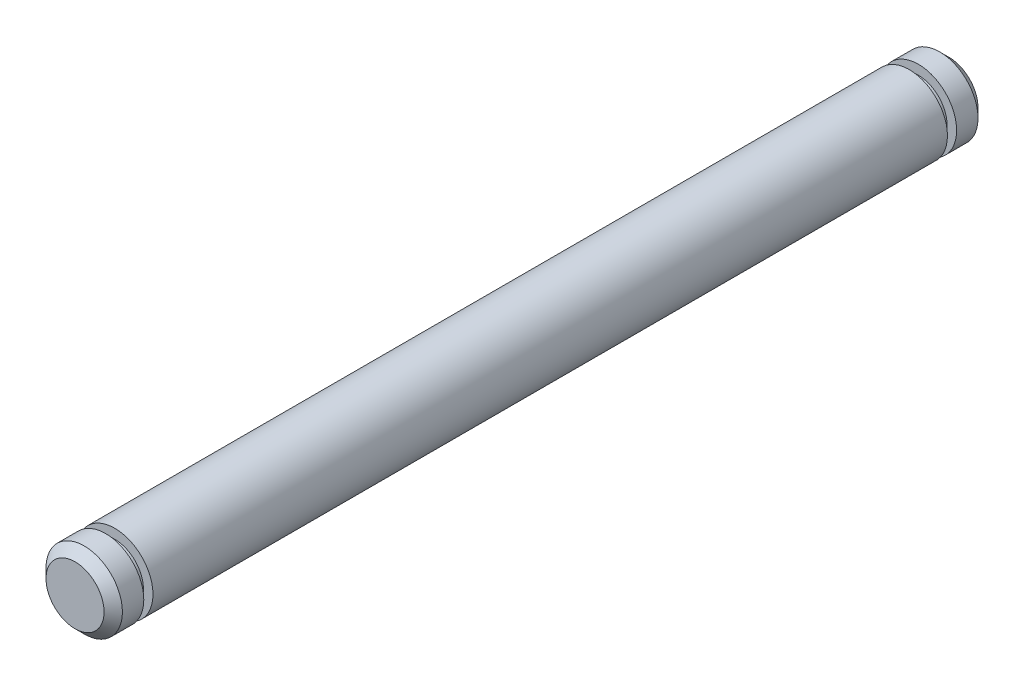
ISO-10303-21;
HEADER;
FILE_DESCRIPTION(('STEP AP214'),'2;1');
FILE_NAME('part.step','',(''),(''),'','','');
FILE_SCHEMA(('AUTOMOTIVE_DESIGN { 1 0 10303 214 1 1 1 1 }'));
ENDSEC;
DATA;
#1=APPLICATION_CONTEXT('core data for automotive mechanical design processes');
#2=APPLICATION_PROTOCOL_DEFINITION('international standard','automotive_design',2000,#1);
#3=PRODUCT_CONTEXT('',#1,'mechanical');
#4=PRODUCT('Part','Part','',(#3));
#5=PRODUCT_RELATED_PRODUCT_CATEGORY('part','',(#4));
#6=PRODUCT_DEFINITION_FORMATION('','',#4);
#7=PRODUCT_DEFINITION_CONTEXT('part definition',#1,'design');
#8=PRODUCT_DEFINITION('design','',#6,#7);
#9=PRODUCT_DEFINITION_SHAPE('','',#8);
#10=(LENGTH_UNIT() NAMED_UNIT(*) SI_UNIT(.MILLI.,.METRE.));
#11=(NAMED_UNIT(*) PLANE_ANGLE_UNIT() SI_UNIT($,.RADIAN.));
#12=(NAMED_UNIT(*) SI_UNIT($,.STERADIAN.) SOLID_ANGLE_UNIT());
#13=UNCERTAINTY_MEASURE_WITH_UNIT(LENGTH_MEASURE(1.E-05),#10,'distance_accuracy_value','');
#14=(GEOMETRIC_REPRESENTATION_CONTEXT(3) GLOBAL_UNCERTAINTY_ASSIGNED_CONTEXT((#13)) GLOBAL_UNIT_ASSIGNED_CONTEXT((#10,
#11,#12)) REPRESENTATION_CONTEXT('',''));
#15=CARTESIAN_POINT('',(0.,0.,0.));
#16=DIRECTION('',(0.,0.,1.));
#17=DIRECTION('',(1.,0.,0.));
#18=AXIS2_PLACEMENT_3D('',#15,#16,#17);
#19=CARTESIAN_POINT('',(0.,0.,16.50746));
#20=DIRECTION('',(0.,0.,-1.));
#21=DIRECTION('',(-1.,0.,0.));
#22=AXIS2_PLACEMENT_3D('',#19,#20,#21);
#23=CYLINDRICAL_SURFACE('',#22,1.5875);
#24=CARTESIAN_POINT('',(0.,0.,16.50746));
#25=DIRECTION('',(0.,0.,1.));
#26=DIRECTION('',(1.,0.,0.));
#27=AXIS2_PLACEMENT_3D('',#24,#25,#26);
#28=CIRCLE('',#27,1.5875);
#29=CARTESIAN_POINT('',(1.5875,0.,16.50746));
#30=VERTEX_POINT('',#29);
#31=EDGE_CURVE('E54',#30,#30,#28,.T.);
#32=ORIENTED_EDGE('',*,*,#31,.F.);
#33=EDGE_LOOP('',(#32));
#34=FACE_BOUND('',#33,.T.);
#35=CARTESIAN_POINT('',(0.,0.,-16.50746));
#36=DIRECTION('',(0.,0.,1.));
#37=DIRECTION('',(1.,0.,0.));
#38=AXIS2_PLACEMENT_3D('',#35,#36,#37);
#39=CIRCLE('',#38,1.5875);
#40=CARTESIAN_POINT('',(1.5875,0.,-16.50746));
#41=VERTEX_POINT('',#40);
#42=EDGE_CURVE('E51',#41,#41,#39,.T.);
#43=ORIENTED_EDGE('',*,*,#42,.T.);
#44=EDGE_LOOP('',(#43));
#45=FACE_BOUND('',#44,.T.);
#46=ADVANCED_FACE('F30',(#34,#45),#23,.T.);
#47=CARTESIAN_POINT('',(0.,0.,16.50746));
#48=DIRECTION('',(0.,0.,1.));
#49=DIRECTION('',(1.,0.,0.));
#50=AXIS2_PLACEMENT_3D('',#47,#48,#49);
#51=PLANE('',#50);
#52=CARTESIAN_POINT('',(0.,0.,16.50746));
#53=DIRECTION('',(0.,0.,1.));
#54=DIRECTION('',(1.,0.,0.));
#55=AXIS2_PLACEMENT_3D('',#52,#53,#54);
#56=CIRCLE('',#55,1.19126);
#57=CARTESIAN_POINT('',(1.19126,0.,16.50746));
#58=VERTEX_POINT('',#57);
#59=EDGE_CURVE('E50',#58,#58,#56,.T.);
#60=ORIENTED_EDGE('',*,*,#59,.F.);
#61=EDGE_LOOP('',(#60));
#62=FACE_BOUND('',#61,.T.);
#63=ORIENTED_EDGE('',*,*,#31,.T.);
#64=EDGE_LOOP('',(#63));
#65=FACE_BOUND('',#64,.T.);
#66=ADVANCED_FACE('F92',(#62,#65),#51,.T.);
#67=CARTESIAN_POINT('',(0.,0.,-16.50746));
#68=DIRECTION('',(0.,0.,1.));
#69=DIRECTION('',(1.,0.,0.));
#70=AXIS2_PLACEMENT_3D('',#67,#68,#69);
#71=PLANE('',#70);
#72=CARTESIAN_POINT('',(0.,0.,-16.50746));
#73=DIRECTION('',(0.,0.,1.));
#74=DIRECTION('',(1.,0.,0.));
#75=AXIS2_PLACEMENT_3D('',#72,#73,#74);
#76=CIRCLE('',#75,1.19126);
#77=CARTESIAN_POINT('',(1.19126,0.,-16.50746));
#78=VERTEX_POINT('',#77);
#79=EDGE_CURVE('E65',#78,#78,#76,.T.);
#80=ORIENTED_EDGE('',*,*,#79,.T.);
#81=EDGE_LOOP('',(#80));
#82=FACE_BOUND('',#81,.T.);
#83=ORIENTED_EDGE('',*,*,#42,.F.);
#84=EDGE_LOOP('',(#83));
#85=FACE_BOUND('',#84,.T.);
#86=ADVANCED_FACE('F98',(#82,#85),#71,.F.);
#87=CARTESIAN_POINT('',(0.,0.,16.88846));
#88=DIRECTION('',(0.,0.,-1.));
#89=DIRECTION('',(-1.,0.,0.));
#90=AXIS2_PLACEMENT_3D('',#87,#88,#89);
#91=CYLINDRICAL_SURFACE('',#90,1.19126);
#92=CARTESIAN_POINT('',(0.,0.,16.88846));
#93=DIRECTION('',(0.,0.,1.));
#94=DIRECTION('',(1.,0.,0.));
#95=AXIS2_PLACEMENT_3D('',#92,#93,#94);
#96=CIRCLE('',#95,1.19126);
#97=CARTESIAN_POINT('',(1.19126,0.,16.88846));
#98=VERTEX_POINT('',#97);
#99=EDGE_CURVE('E55',#98,#98,#96,.T.);
#100=ORIENTED_EDGE('',*,*,#99,.F.);
#101=EDGE_LOOP('',(#100));
#102=FACE_BOUND('',#101,.T.);
#103=ORIENTED_EDGE('',*,*,#59,.T.);
#104=EDGE_LOOP('',(#103));
#105=FACE_BOUND('',#104,.T.);
#106=ADVANCED_FACE('F123',(#102,#105),#91,.T.);
#107=CARTESIAN_POINT('',(0.,0.,18.15846));
#108=DIRECTION('',(0.,0.,-1.));
#109=DIRECTION('',(-1.,0.,0.));
#110=AXIS2_PLACEMENT_3D('',#107,#108,#109);
#111=CYLINDRICAL_SURFACE('',#110,1.5875);
#112=CARTESIAN_POINT('',(0.,0.,17.77746));
#113=DIRECTION('',(0.,0.,1.));
#114=DIRECTION('',(1.,0.,0.));
#115=AXIS2_PLACEMENT_3D('',#112,#113,#114);
#116=CIRCLE('',#115,1.5875);
#117=CARTESIAN_POINT('',(1.5875,0.,17.77746));
#118=VERTEX_POINT('',#117);
#119=EDGE_CURVE('E41',#118,#118,#116,.F.);
#120=ORIENTED_EDGE('',*,*,#119,.T.);
#121=EDGE_LOOP('',(#120));
#122=FACE_BOUND('',#121,.T.);
#123=CARTESIAN_POINT('',(0.,0.,16.88846));
#124=DIRECTION('',(0.,0.,1.));
#125=DIRECTION('',(1.,0.,0.));
#126=AXIS2_PLACEMENT_3D('',#123,#124,#125);
#127=CIRCLE('',#126,1.5875);
#128=CARTESIAN_POINT('',(1.5875,0.,16.88846));
#129=VERTEX_POINT('',#128);
#130=EDGE_CURVE('E62',#129,#129,#127,.T.);
#131=ORIENTED_EDGE('',*,*,#130,.T.);
#132=EDGE_LOOP('',(#131));
#133=FACE_BOUND('',#132,.T.);
#134=ADVANCED_FACE('F118',(#122,#133),#111,.T.);
#135=CARTESIAN_POINT('',(0.,0.,18.15846));
#136=DIRECTION('',(0.,0.,1.));
#137=DIRECTION('',(1.,0.,0.));
#138=AXIS2_PLACEMENT_3D('',#135,#136,#137);
#139=PLANE('',#138);
#140=CARTESIAN_POINT('',(0.,0.,18.15846));
#141=DIRECTION('',(0.,0.,1.));
#142=DIRECTION('',(1.,0.,0.));
#143=AXIS2_PLACEMENT_3D('',#140,#141,#142);
#144=CIRCLE('',#143,1.2065);
#145=CARTESIAN_POINT('',(1.2065,0.,18.15846));
#146=VERTEX_POINT('',#145);
#147=EDGE_CURVE('E45',#146,#146,#144,.T.);
#148=ORIENTED_EDGE('',*,*,#147,.T.);
#149=EDGE_LOOP('',(#148));
#150=FACE_BOUND('',#149,.T.);
#151=ADVANCED_FACE('F110',(#150),#139,.T.);
#152=CARTESIAN_POINT('',(0.,0.,16.88846));
#153=DIRECTION('',(0.,0.,1.));
#154=DIRECTION('',(1.,0.,0.));
#155=AXIS2_PLACEMENT_3D('',#152,#153,#154);
#156=PLANE('',#155);
#157=ORIENTED_EDGE('',*,*,#99,.T.);
#158=EDGE_LOOP('',(#157));
#159=FACE_BOUND('',#158,.T.);
#160=ORIENTED_EDGE('',*,*,#130,.F.);
#161=EDGE_LOOP('',(#160));
#162=FACE_BOUND('',#161,.T.);
#163=ADVANCED_FACE('F105',(#159,#162),#156,.F.);
#164=CARTESIAN_POINT('',(0.,0.,18.15846));
#165=DIRECTION('',(0.,0.,-1.));
#166=DIRECTION('',(-1.,0.,0.));
#167=AXIS2_PLACEMENT_3D('',#164,#165,#166);
#168=CONICAL_SURFACE('',#167,1.2065,0.785398163397446);
#169=ORIENTED_EDGE('',*,*,#119,.F.);
#170=EDGE_LOOP('',(#169));
#171=FACE_BOUND('',#170,.T.);
#172=ORIENTED_EDGE('',*,*,#147,.F.);
#173=EDGE_LOOP('',(#172));
#174=FACE_BOUND('',#173,.T.);
#175=ADVANCED_FACE('F87',(#171,#174),#168,.T.);
#176=CARTESIAN_POINT('',(0.,0.,-16.88846));
#177=DIRECTION('',(0.,0.,1.));
#178=DIRECTION('',(1.,0.,0.));
#179=AXIS2_PLACEMENT_3D('',#176,#177,#178);
#180=CYLINDRICAL_SURFACE('',#179,1.19126);
#181=CARTESIAN_POINT('',(0.,0.,-16.88846));
#182=DIRECTION('',(0.,0.,1.));
#183=DIRECTION('',(1.,0.,0.));
#184=AXIS2_PLACEMENT_3D('',#181,#182,#183);
#185=CIRCLE('',#184,1.19126);
#186=CARTESIAN_POINT('',(1.19126,0.,-16.88846));
#187=VERTEX_POINT('',#186);
#188=EDGE_CURVE('E68',#187,#187,#185,.T.);
#189=ORIENTED_EDGE('',*,*,#188,.T.);
#190=EDGE_LOOP('',(#189));
#191=FACE_BOUND('',#190,.T.);
#192=ORIENTED_EDGE('',*,*,#79,.F.);
#193=EDGE_LOOP('',(#192));
#194=FACE_BOUND('',#193,.T.);
#195=ADVANCED_FACE('F80',(#191,#194),#180,.T.);
#196=CARTESIAN_POINT('',(0.,0.,-18.15846));
#197=DIRECTION('',(0.,0.,1.));
#198=DIRECTION('',(1.,0.,0.));
#199=AXIS2_PLACEMENT_3D('',#196,#197,#198);
#200=CYLINDRICAL_SURFACE('',#199,1.5875);
#201=CARTESIAN_POINT('',(0.,0.,-17.77746));
#202=DIRECTION('',(0.,0.,-1.));
#203=DIRECTION('',(-1.,0.,0.));
#204=AXIS2_PLACEMENT_3D('',#201,#202,#203);
#205=CIRCLE('',#204,1.5875);
#206=CARTESIAN_POINT('',(-1.5875,0.,-17.77746));
#207=VERTEX_POINT('',#206);
#208=EDGE_CURVE('E37',#207,#207,#205,.F.);
#209=ORIENTED_EDGE('',*,*,#208,.T.);
#210=EDGE_LOOP('',(#209));
#211=FACE_BOUND('',#210,.T.);
#212=CARTESIAN_POINT('',(0.,0.,-16.88846));
#213=DIRECTION('',(0.,0.,1.));
#214=DIRECTION('',(1.,0.,0.));
#215=AXIS2_PLACEMENT_3D('',#212,#213,#214);
#216=CIRCLE('',#215,1.5875);
#217=CARTESIAN_POINT('',(1.5875,0.,-16.88846));
#218=VERTEX_POINT('',#217);
#219=EDGE_CURVE('E71',#218,#218,#216,.T.);
#220=ORIENTED_EDGE('',*,*,#219,.F.);
#221=EDGE_LOOP('',(#220));
#222=FACE_BOUND('',#221,.T.);
#223=ADVANCED_FACE('F77',(#211,#222),#200,.T.);
#224=CARTESIAN_POINT('',(0.,0.,-18.15846));
#225=DIRECTION('',(0.,0.,-1.));
#226=DIRECTION('',(1.,0.,0.));
#227=AXIS2_PLACEMENT_3D('',#224,#225,#226);
#228=PLANE('',#227);
#229=CARTESIAN_POINT('',(0.,0.,-18.15846));
#230=DIRECTION('',(0.,0.,-1.));
#231=DIRECTION('',(-1.,0.,0.));
#232=AXIS2_PLACEMENT_3D('',#229,#230,#231);
#233=CIRCLE('',#232,1.2065);
#234=CARTESIAN_POINT('',(-1.2065,0.,-18.15846));
#235=VERTEX_POINT('',#234);
#236=EDGE_CURVE('E10',#235,#235,#233,.T.);
#237=ORIENTED_EDGE('',*,*,#236,.T.);
#238=EDGE_LOOP('',(#237));
#239=FACE_BOUND('',#238,.T.);
#240=ADVANCED_FACE('F79',(#239),#228,.T.);
#241=CARTESIAN_POINT('',(0.,0.,-16.88846));
#242=DIRECTION('',(0.,0.,-1.));
#243=DIRECTION('',(1.,0.,0.));
#244=AXIS2_PLACEMENT_3D('',#241,#242,#243);
#245=PLANE('',#244);
#246=ORIENTED_EDGE('',*,*,#188,.F.);
#247=EDGE_LOOP('',(#246));
#248=FACE_BOUND('',#247,.T.);
#249=ORIENTED_EDGE('',*,*,#219,.T.);
#250=EDGE_LOOP('',(#249));
#251=FACE_BOUND('',#250,.T.);
#252=ADVANCED_FACE('F75',(#248,#251),#245,.F.);
#253=CARTESIAN_POINT('',(0.,0.,-17.77746));
#254=DIRECTION('',(0.,0.,1.));
#255=DIRECTION('',(1.,0.,0.));
#256=AXIS2_PLACEMENT_3D('',#253,#254,#255);
#257=CONICAL_SURFACE('',#256,1.5875,0.78539816339745);
#258=ORIENTED_EDGE('',*,*,#236,.F.);
#259=EDGE_LOOP('',(#258));
#260=FACE_BOUND('',#259,.T.);
#261=ORIENTED_EDGE('',*,*,#208,.F.);
#262=EDGE_LOOP('',(#261));
#263=FACE_BOUND('',#262,.T.);
#264=ADVANCED_FACE('F32',(#260,#263),#257,.T.);
#265=CLOSED_SHELL('',(#46,#66,#86,#106,#134,#151,#163,#175,#195,#223,#240,#252,#264));
#266=MANIFOLD_SOLID_BREP('B2',#265);
#267=ADVANCED_BREP_SHAPE_REPRESENTATION('',(#18,#266),#14);
#268=SHAPE_DEFINITION_REPRESENTATION(#9,#267);
ENDSEC;
END-ISO-10303-21;
